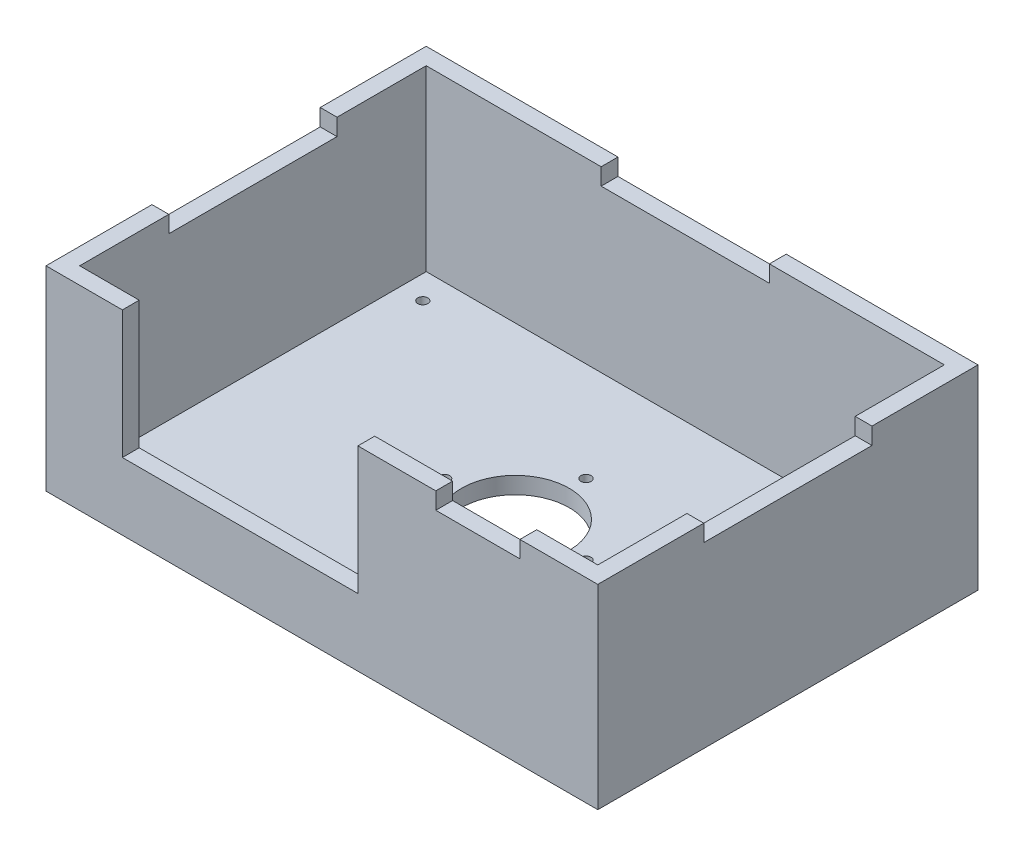
ISO-10303-21;
HEADER;
FILE_DESCRIPTION(('STEP AP214'),'2;1');
FILE_NAME('part.step','',(''),(''),'','','');
FILE_SCHEMA(('AUTOMOTIVE_DESIGN { 1 0 10303 214 1 1 1 1 }'));
ENDSEC;
DATA;
#1=APPLICATION_CONTEXT('core data for automotive mechanical design processes');
#2=APPLICATION_PROTOCOL_DEFINITION('international standard','automotive_design',2000,#1);
#3=PRODUCT_CONTEXT('',#1,'mechanical');
#4=PRODUCT('Part','Part','',(#3));
#5=PRODUCT_RELATED_PRODUCT_CATEGORY('part','',(#4));
#6=PRODUCT_DEFINITION_FORMATION('','',#4);
#7=PRODUCT_DEFINITION_CONTEXT('part definition',#1,'design');
#8=PRODUCT_DEFINITION('design','',#6,#7);
#9=PRODUCT_DEFINITION_SHAPE('','',#8);
#10=(LENGTH_UNIT() NAMED_UNIT(*) SI_UNIT(.MILLI.,.METRE.));
#11=(NAMED_UNIT(*) PLANE_ANGLE_UNIT() SI_UNIT($,.RADIAN.));
#12=(NAMED_UNIT(*) SI_UNIT($,.STERADIAN.) SOLID_ANGLE_UNIT());
#13=UNCERTAINTY_MEASURE_WITH_UNIT(LENGTH_MEASURE(1.E-05),#10,'distance_accuracy_value','');
#14=(GEOMETRIC_REPRESENTATION_CONTEXT(3) GLOBAL_UNCERTAINTY_ASSIGNED_CONTEXT((#13)) GLOBAL_UNIT_ASSIGNED_CONTEXT((#10,
#11,#12)) REPRESENTATION_CONTEXT('',''));
#15=CARTESIAN_POINT('',(0.,0.,0.));
#16=DIRECTION('',(0.,0.,1.));
#17=DIRECTION('',(1.,0.,0.));
#18=AXIS2_PLACEMENT_3D('',#15,#16,#17);
#19=CARTESIAN_POINT('',(0.,58.,0.));
#20=DIRECTION('',(0.,1.,0.));
#21=DIRECTION('',(0.,0.,1.));
#22=AXIS2_PLACEMENT_3D('',#19,#20,#21);
#23=PLANE('',#22);
#24=DIRECTION('',(0.,0.,1.));
#25=VECTOR('',#24,1.);
#26=CARTESIAN_POINT('',(33.85,58.,52.5));
#27=LINE('',#26,#25);
#28=CARTESIAN_POINT('',(33.85,58.,52.5));
#29=VERTEX_POINT('',#28);
#30=CARTESIAN_POINT('',(33.85,58.,57.5));
#31=VERTEX_POINT('',#30);
#32=EDGE_CURVE('E530',#29,#31,#27,.T.);
#33=ORIENTED_EDGE('',*,*,#32,.F.);
#34=DIRECTION('',(1.,0.,0.));
#35=VECTOR('',#34,1.);
#36=CARTESIAN_POINT('',(-77.,58.,52.5));
#37=LINE('',#36,#35);
#38=CARTESIAN_POINT('',(10.7,58.,52.5));
#39=VERTEX_POINT('',#38);
#40=EDGE_CURVE('E354',#39,#29,#37,.T.);
#41=ORIENTED_EDGE('',*,*,#40,.F.);
#42=DIRECTION('',(0.,0.,-1.));
#43=VECTOR('',#42,1.);
#44=CARTESIAN_POINT('',(10.7,58.,52.5));
#45=LINE('',#44,#43);
#46=CARTESIAN_POINT('',(10.7,58.,57.5));
#47=VERTEX_POINT('',#46);
#48=EDGE_CURVE('E324',#47,#39,#45,.T.);
#49=ORIENTED_EDGE('',*,*,#48,.F.);
#50=DIRECTION('',(1.,0.,0.));
#51=VECTOR('',#50,1.);
#52=CARTESIAN_POINT('',(-82.,58.,57.5));
#53=LINE('',#52,#51);
#54=EDGE_CURVE('E370',#47,#31,#53,.T.);
#55=ORIENTED_EDGE('',*,*,#54,.T.);
#56=EDGE_LOOP('',(#33,#41,#49,#55));
#57=FACE_BOUND('',#56,.T.);
#58=ADVANCED_FACE('F33',(#57),#23,.T.);
#59=DIRECTION('',(0.,0.,1.));
#60=VECTOR('',#59,1.);
#61=CARTESIAN_POINT('',(-25.,58.,-55.5));
#62=LINE('',#61,#60);
#63=CARTESIAN_POINT('',(-25.,58.,-55.5));
#64=VERTEX_POINT('',#63);
#65=CARTESIAN_POINT('',(-25.,58.,-50.5));
#66=VERTEX_POINT('',#65);
#67=EDGE_CURVE('E258',#64,#66,#62,.T.);
#68=ORIENTED_EDGE('',*,*,#67,.F.);
#69=DIRECTION('',(-1.,0.,0.));
#70=VECTOR('',#69,1.);
#71=CARTESIAN_POINT('',(-82.,58.,-55.5));
#72=LINE('',#71,#70);
#73=CARTESIAN_POINT('',(-82.,58.,-55.5));
#74=VERTEX_POINT('',#73);
#75=EDGE_CURVE('E374',#64,#74,#72,.T.);
#76=ORIENTED_EDGE('',*,*,#75,.T.);
#77=DIRECTION('',(0.,0.,1.));
#78=VECTOR('',#77,1.);
#79=CARTESIAN_POINT('',(-82.,58.,-55.5));
#80=LINE('',#79,#78);
#81=CARTESIAN_POINT('',(-82.,58.,-24.));
#82=VERTEX_POINT('',#81);
#83=EDGE_CURVE('E363',#74,#82,#80,.T.);
#84=ORIENTED_EDGE('',*,*,#83,.T.);
#85=DIRECTION('',(-1.,0.,0.));
#86=VECTOR('',#85,1.);
#87=CARTESIAN_POINT('',(-82.,58.,-24.));
#88=LINE('',#87,#86);
#89=CARTESIAN_POINT('',(-77.,58.,-24.));
#90=VERTEX_POINT('',#89);
#91=EDGE_CURVE('E301',#90,#82,#88,.T.);
#92=ORIENTED_EDGE('',*,*,#91,.F.);
#93=DIRECTION('',(0.,0.,1.));
#94=VECTOR('',#93,1.);
#95=CARTESIAN_POINT('',(-77.,58.,-50.5));
#96=LINE('',#95,#94);
#97=CARTESIAN_POINT('',(-77.,58.,-50.5));
#98=VERTEX_POINT('',#97);
#99=EDGE_CURVE('E346',#98,#90,#96,.T.);
#100=ORIENTED_EDGE('',*,*,#99,.F.);
#101=DIRECTION('',(-1.,0.,0.));
#102=VECTOR('',#101,1.);
#103=CARTESIAN_POINT('',(-77.,58.,-50.5));
#104=LINE('',#103,#102);
#105=EDGE_CURVE('E358',#66,#98,#104,.T.);
#106=ORIENTED_EDGE('',*,*,#105,.F.);
#107=EDGE_LOOP('',(#68,#76,#84,#92,#100,#106));
#108=FACE_BOUND('',#107,.T.);
#109=ADVANCED_FACE('F488',(#108),#23,.T.);
#110=DIRECTION('',(0.,0.,-1.));
#111=VECTOR('',#110,1.);
#112=CARTESIAN_POINT('',(25.,58.,-55.5));
#113=LINE('',#112,#111);
#114=CARTESIAN_POINT('',(25.,58.,-50.5));
#115=VERTEX_POINT('',#114);
#116=CARTESIAN_POINT('',(25.,58.,-55.5));
#117=VERTEX_POINT('',#116);
#118=EDGE_CURVE('E248',#115,#117,#113,.T.);
#119=ORIENTED_EDGE('',*,*,#118,.F.);
#120=CARTESIAN_POINT('',(77.,58.,-50.5));
#121=VERTEX_POINT('',#120);
#122=EDGE_CURVE('E359',#121,#115,#104,.T.);
#123=ORIENTED_EDGE('',*,*,#122,.F.);
#124=DIRECTION('',(0.,0.,-1.));
#125=VECTOR('',#124,1.);
#126=CARTESIAN_POINT('',(77.,58.,-50.5));
#127=LINE('',#126,#125);
#128=CARTESIAN_POINT('',(77.,58.,-24.));
#129=VERTEX_POINT('',#128);
#130=EDGE_CURVE('E353',#129,#121,#127,.T.);
#131=ORIENTED_EDGE('',*,*,#130,.F.);
#132=DIRECTION('',(-1.,0.,0.));
#133=VECTOR('',#132,1.);
#134=CARTESIAN_POINT('',(77.,58.,-24.));
#135=LINE('',#134,#133);
#136=CARTESIAN_POINT('',(81.9999999999999,58.,-24.));
#137=VERTEX_POINT('',#136);
#138=EDGE_CURVE('E276',#137,#129,#135,.T.);
#139=ORIENTED_EDGE('',*,*,#138,.F.);
#140=DIRECTION('',(0.,0.,-1.));
#141=VECTOR('',#140,1.);
#142=CARTESIAN_POINT('',(82.,58.,-55.5));
#143=LINE('',#142,#141);
#144=CARTESIAN_POINT('',(82.,58.,-55.5));
#145=VERTEX_POINT('',#144);
#146=EDGE_CURVE('E369',#137,#145,#143,.T.);
#147=ORIENTED_EDGE('',*,*,#146,.T.);
#148=EDGE_CURVE('E375',#145,#117,#72,.T.);
#149=ORIENTED_EDGE('',*,*,#148,.T.);
#150=EDGE_LOOP('',(#119,#123,#131,#139,#147,#149));
#151=FACE_BOUND('',#150,.T.);
#152=ADVANCED_FACE('F558',(#151),#23,.T.);
#153=DIRECTION('',(0.,0.,-1.));
#154=VECTOR('',#153,1.);
#155=CARTESIAN_POINT('',(58.85,58.,52.5));
#156=LINE('',#155,#154);
#157=CARTESIAN_POINT('',(58.85,58.,57.5));
#158=VERTEX_POINT('',#157);
#159=CARTESIAN_POINT('',(58.85,58.,52.5));
#160=VERTEX_POINT('',#159);
#161=EDGE_CURVE('E913',#158,#160,#156,.T.);
#162=ORIENTED_EDGE('',*,*,#161,.F.);
#163=CARTESIAN_POINT('',(81.9999999999999,58.,57.5));
#164=VERTEX_POINT('',#163);
#165=EDGE_CURVE('E236',#158,#164,#53,.T.);
#166=ORIENTED_EDGE('',*,*,#165,.T.);
#167=CARTESIAN_POINT('',(81.9999999999999,58.,26.));
#168=VERTEX_POINT('',#167);
#169=EDGE_CURVE('E371',#164,#168,#143,.T.);
#170=ORIENTED_EDGE('',*,*,#169,.T.);
#171=DIRECTION('',(1.,0.,0.));
#172=VECTOR('',#171,1.);
#173=CARTESIAN_POINT('',(77.,58.,26.));
#174=LINE('',#173,#172);
#175=CARTESIAN_POINT('',(77.,58.,26.));
#176=VERTEX_POINT('',#175);
#177=EDGE_CURVE('E285',#176,#168,#174,.T.);
#178=ORIENTED_EDGE('',*,*,#177,.F.);
#179=CARTESIAN_POINT('',(77.,58.,52.5));
#180=VERTEX_POINT('',#179);
#181=EDGE_CURVE('E355',#180,#176,#127,.T.);
#182=ORIENTED_EDGE('',*,*,#181,.F.);
#183=EDGE_CURVE('E349',#160,#180,#37,.T.);
#184=ORIENTED_EDGE('',*,*,#183,.F.);
#185=EDGE_LOOP('',(#162,#166,#170,#178,#182,#184));
#186=FACE_BOUND('',#185,.T.);
#187=ADVANCED_FACE('F539',(#186),#23,.T.);
#188=CARTESIAN_POINT('',(0.,5.,0.));
#189=DIRECTION('',(0.,-1.,0.));
#190=DIRECTION('',(0.,0.,-1.));
#191=AXIS2_PLACEMENT_3D('',#188,#189,#190);
#192=PLANE('',#191);
#193=CARTESIAN_POINT('',(70.,5.,-42.5));
#194=DIRECTION('',(0.,1.,0.));
#195=DIRECTION('',(0.,0.,1.));
#196=AXIS2_PLACEMENT_3D('',#193,#194,#195);
#197=CIRCLE('',#196,1.5);
#198=CARTESIAN_POINT('',(70.,5.,-41.));
#199=VERTEX_POINT('',#198);
#200=EDGE_CURVE('E416',#199,#199,#197,.T.);
#201=ORIENTED_EDGE('',*,*,#200,.F.);
#202=EDGE_LOOP('',(#201));
#203=FACE_BOUND('',#202,.T.);
#204=CARTESIAN_POINT('',(-70.,5.,-42.5));
#205=DIRECTION('',(0.,1.,0.));
#206=DIRECTION('',(0.,0.,1.));
#207=AXIS2_PLACEMENT_3D('',#204,#205,#206);
#208=CIRCLE('',#207,1.5);
#209=CARTESIAN_POINT('',(-70.,5.,-41.));
#210=VERTEX_POINT('',#209);
#211=EDGE_CURVE('E427',#210,#210,#208,.T.);
#212=ORIENTED_EDGE('',*,*,#211,.F.);
#213=EDGE_LOOP('',(#212));
#214=FACE_BOUND('',#213,.T.);
#215=CARTESIAN_POINT('',(-70.,5.,45.5));
#216=DIRECTION('',(0.,1.,0.));
#217=DIRECTION('',(0.,0.,1.));
#218=AXIS2_PLACEMENT_3D('',#215,#216,#217);
#219=CIRCLE('',#218,1.5);
#220=CARTESIAN_POINT('',(-70.,5.,47.));
#221=VERTEX_POINT('',#220);
#222=EDGE_CURVE('E421',#221,#221,#219,.T.);
#223=ORIENTED_EDGE('',*,*,#222,.F.);
#224=EDGE_LOOP('',(#223));
#225=FACE_BOUND('',#224,.T.);
#226=CARTESIAN_POINT('',(70.,5.,45.5));
#227=DIRECTION('',(0.,1.,0.));
#228=DIRECTION('',(0.,0.,1.));
#229=AXIS2_PLACEMENT_3D('',#226,#227,#228);
#230=CIRCLE('',#229,1.5);
#231=CARTESIAN_POINT('',(70.,5.,47.));
#232=VERTEX_POINT('',#231);
#233=EDGE_CURVE('E420',#232,#232,#230,.T.);
#234=ORIENTED_EDGE('',*,*,#233,.F.);
#235=EDGE_LOOP('',(#234));
#236=FACE_BOUND('',#235,.T.);
#237=CARTESIAN_POINT('',(0.,5.,-21.));
#238=DIRECTION('',(0.,1.,0.));
#239=DIRECTION('',(0.,0.,1.));
#240=AXIS2_PLACEMENT_3D('',#237,#238,#239);
#241=CIRCLE('',#240,1.5);
#242=CARTESIAN_POINT('',(0.,5.,-19.5));
#243=VERTEX_POINT('',#242);
#244=EDGE_CURVE('E453',#243,#243,#241,.T.);
#245=ORIENTED_EDGE('',*,*,#244,.F.);
#246=EDGE_LOOP('',(#245));
#247=FACE_BOUND('',#246,.T.);
#248=CARTESIAN_POINT('',(-21.,5.,0.));
#249=DIRECTION('',(0.,1.,0.));
#250=DIRECTION('',(0.,0.,1.));
#251=AXIS2_PLACEMENT_3D('',#248,#249,#250);
#252=CIRCLE('',#251,1.5);
#253=CARTESIAN_POINT('',(-21.,5.,1.5));
#254=VERTEX_POINT('',#253);
#255=EDGE_CURVE('E460',#254,#254,#252,.T.);
#256=ORIENTED_EDGE('',*,*,#255,.F.);
#257=EDGE_LOOP('',(#256));
#258=FACE_BOUND('',#257,.T.);
#259=CARTESIAN_POINT('',(21.,5.,0.));
#260=DIRECTION('',(0.,1.,0.));
#261=DIRECTION('',(0.,0.,1.));
#262=AXIS2_PLACEMENT_3D('',#259,#260,#261);
#263=CIRCLE('',#262,1.5);
#264=CARTESIAN_POINT('',(21.,5.,1.5));
#265=VERTEX_POINT('',#264);
#266=EDGE_CURVE('E441',#265,#265,#263,.T.);
#267=ORIENTED_EDGE('',*,*,#266,.F.);
#268=EDGE_LOOP('',(#267));
#269=FACE_BOUND('',#268,.T.);
#270=CARTESIAN_POINT('',(0.,5.,21.));
#271=DIRECTION('',(0.,1.,0.));
#272=DIRECTION('',(0.,0.,1.));
#273=AXIS2_PLACEMENT_3D('',#270,#271,#272);
#274=CIRCLE('',#273,1.5);
#275=CARTESIAN_POINT('',(0.,5.,22.5));
#276=VERTEX_POINT('',#275);
#277=EDGE_CURVE('E448',#276,#276,#274,.T.);
#278=ORIENTED_EDGE('',*,*,#277,.F.);
#279=EDGE_LOOP('',(#278));
#280=FACE_BOUND('',#279,.T.);
#281=CARTESIAN_POINT('',(0.,5.,0.));
#282=DIRECTION('',(0.,1.,0.));
#283=DIRECTION('',(0.,0.,1.));
#284=AXIS2_PLACEMENT_3D('',#281,#282,#283);
#285=CIRCLE('',#284,16.);
#286=CARTESIAN_POINT('',(0.,5.,16.));
#287=VERTEX_POINT('',#286);
#288=EDGE_CURVE('E456',#287,#287,#285,.T.);
#289=ORIENTED_EDGE('',*,*,#288,.F.);
#290=EDGE_LOOP('',(#289));
#291=FACE_BOUND('',#290,.T.);
#292=DIRECTION('',(0.,0.,-1.));
#293=VECTOR('',#292,1.);
#294=CARTESIAN_POINT('',(77.,5.,50.5));
#295=LINE('',#294,#293);
#296=CARTESIAN_POINT('',(77.,5.,52.5));
#297=VERTEX_POINT('',#296);
#298=CARTESIAN_POINT('',(77.,5.,-50.5));
#299=VERTEX_POINT('',#298);
#300=EDGE_CURVE('E468',#297,#299,#295,.T.);
#301=ORIENTED_EDGE('',*,*,#300,.T.);
#302=DIRECTION('',(-1.,0.,0.));
#303=VECTOR('',#302,1.);
#304=CARTESIAN_POINT('',(-77.,5.,-50.5));
#305=LINE('',#304,#303);
#306=CARTESIAN_POINT('',(-77.,5.,-50.5));
#307=VERTEX_POINT('',#306);
#308=EDGE_CURVE('E41',#299,#307,#305,.T.);
#309=ORIENTED_EDGE('',*,*,#308,.T.);
#310=DIRECTION('',(0.,0.,1.));
#311=VECTOR('',#310,1.);
#312=CARTESIAN_POINT('',(-77.,5.,50.5));
#313=LINE('',#312,#311);
#314=CARTESIAN_POINT('',(-77.,5.,52.5));
#315=VERTEX_POINT('',#314);
#316=EDGE_CURVE('E11',#307,#315,#313,.T.);
#317=ORIENTED_EDGE('',*,*,#316,.T.);
#318=DIRECTION('',(-1.,0.,0.));
#319=VECTOR('',#318,1.);
#320=CARTESIAN_POINT('',(77.,5.,52.5));
#321=LINE('',#320,#319);
#322=EDGE_CURVE('E406',#297,#315,#321,.T.);
#323=ORIENTED_EDGE('',*,*,#322,.F.);
#324=EDGE_LOOP('',(#301,#309,#317,#323));
#325=FACE_BOUND('',#324,.T.);
#326=ADVANCED_FACE('F474',(#203,#214,#225,#236,#247,#258,#269,#280,#291,#325),#192,.F.);
#327=CARTESIAN_POINT('',(0.,0.,0.));
#328=DIRECTION('',(0.,-1.,0.));
#329=DIRECTION('',(0.,0.,-1.));
#330=AXIS2_PLACEMENT_3D('',#327,#328,#329);
#331=PLANE('',#330);
#332=CARTESIAN_POINT('',(70.,0.,-42.5));
#333=DIRECTION('',(0.,1.,0.));
#334=DIRECTION('',(0.,0.,1.));
#335=AXIS2_PLACEMENT_3D('',#332,#333,#334);
#336=CIRCLE('',#335,1.5);
#337=CARTESIAN_POINT('',(70.,0.,-41.));
#338=VERTEX_POINT('',#337);
#339=EDGE_CURVE('E430',#338,#338,#336,.T.);
#340=ORIENTED_EDGE('',*,*,#339,.T.);
#341=EDGE_LOOP('',(#340));
#342=FACE_BOUND('',#341,.T.);
#343=CARTESIAN_POINT('',(-70.,0.,-42.5));
#344=DIRECTION('',(0.,1.,0.));
#345=DIRECTION('',(0.,0.,1.));
#346=AXIS2_PLACEMENT_3D('',#343,#344,#345);
#347=CIRCLE('',#346,1.5);
#348=CARTESIAN_POINT('',(-70.,0.,-41.));
#349=VERTEX_POINT('',#348);
#350=EDGE_CURVE('E424',#349,#349,#347,.T.);
#351=ORIENTED_EDGE('',*,*,#350,.T.);
#352=EDGE_LOOP('',(#351));
#353=FACE_BOUND('',#352,.T.);
#354=CARTESIAN_POINT('',(-70.,0.,45.5));
#355=DIRECTION('',(0.,1.,0.));
#356=DIRECTION('',(0.,0.,1.));
#357=AXIS2_PLACEMENT_3D('',#354,#355,#356);
#358=CIRCLE('',#357,1.5);
#359=CARTESIAN_POINT('',(-70.,0.,47.));
#360=VERTEX_POINT('',#359);
#361=EDGE_CURVE('E417',#360,#360,#358,.T.);
#362=ORIENTED_EDGE('',*,*,#361,.T.);
#363=EDGE_LOOP('',(#362));
#364=FACE_BOUND('',#363,.T.);
#365=CARTESIAN_POINT('',(70.,0.,45.5));
#366=DIRECTION('',(0.,1.,0.));
#367=DIRECTION('',(0.,0.,1.));
#368=AXIS2_PLACEMENT_3D('',#365,#366,#367);
#369=CIRCLE('',#368,1.5);
#370=CARTESIAN_POINT('',(70.,0.,47.));
#371=VERTEX_POINT('',#370);
#372=EDGE_CURVE('E435',#371,#371,#369,.T.);
#373=ORIENTED_EDGE('',*,*,#372,.T.);
#374=EDGE_LOOP('',(#373));
#375=FACE_BOUND('',#374,.T.);
#376=CARTESIAN_POINT('',(0.,0.,-21.));
#377=DIRECTION('',(0.,1.,0.));
#378=DIRECTION('',(0.,0.,1.));
#379=AXIS2_PLACEMENT_3D('',#376,#377,#378);
#380=CIRCLE('',#379,1.5);
#381=CARTESIAN_POINT('',(0.,0.,-19.5));
#382=VERTEX_POINT('',#381);
#383=EDGE_CURVE('E457',#382,#382,#380,.T.);
#384=ORIENTED_EDGE('',*,*,#383,.T.);
#385=EDGE_LOOP('',(#384));
#386=FACE_BOUND('',#385,.T.);
#387=CARTESIAN_POINT('',(-21.,0.,0.));
#388=DIRECTION('',(0.,1.,0.));
#389=DIRECTION('',(0.,0.,1.));
#390=AXIS2_PLACEMENT_3D('',#387,#388,#389);
#391=CIRCLE('',#390,1.5);
#392=CARTESIAN_POINT('',(-21.,0.,1.5));
#393=VERTEX_POINT('',#392);
#394=EDGE_CURVE('E444',#393,#393,#391,.T.);
#395=ORIENTED_EDGE('',*,*,#394,.T.);
#396=EDGE_LOOP('',(#395));
#397=FACE_BOUND('',#396,.T.);
#398=CARTESIAN_POINT('',(21.,0.,0.));
#399=DIRECTION('',(0.,1.,0.));
#400=DIRECTION('',(0.,0.,1.));
#401=AXIS2_PLACEMENT_3D('',#398,#399,#400);
#402=CIRCLE('',#401,1.5);
#403=CARTESIAN_POINT('',(21.,0.,1.5));
#404=VERTEX_POINT('',#403);
#405=EDGE_CURVE('E445',#404,#404,#402,.T.);
#406=ORIENTED_EDGE('',*,*,#405,.T.);
#407=EDGE_LOOP('',(#406));
#408=FACE_BOUND('',#407,.T.);
#409=CARTESIAN_POINT('',(0.,0.,21.));
#410=DIRECTION('',(0.,1.,0.));
#411=DIRECTION('',(0.,0.,1.));
#412=AXIS2_PLACEMENT_3D('',#409,#410,#411);
#413=CIRCLE('',#412,1.5);
#414=CARTESIAN_POINT('',(0.,0.,22.5));
#415=VERTEX_POINT('',#414);
#416=EDGE_CURVE('E438',#415,#415,#413,.T.);
#417=ORIENTED_EDGE('',*,*,#416,.T.);
#418=EDGE_LOOP('',(#417));
#419=FACE_BOUND('',#418,.T.);
#420=CARTESIAN_POINT('',(0.,0.,0.));
#421=DIRECTION('',(0.,1.,0.));
#422=DIRECTION('',(0.,0.,1.));
#423=AXIS2_PLACEMENT_3D('',#420,#421,#422);
#424=CIRCLE('',#423,16.);
#425=CARTESIAN_POINT('',(0.,0.,16.));
#426=VERTEX_POINT('',#425);
#427=EDGE_CURVE('E465',#426,#426,#424,.T.);
#428=ORIENTED_EDGE('',*,*,#427,.T.);
#429=EDGE_LOOP('',(#428));
#430=FACE_BOUND('',#429,.T.);
#431=DIRECTION('',(0.,0.,1.));
#432=VECTOR('',#431,1.);
#433=CARTESIAN_POINT('',(-82.,0.,-55.5));
#434=LINE('',#433,#432);
#435=CARTESIAN_POINT('',(-82.,0.,-55.5));
#436=VERTEX_POINT('',#435);
#437=CARTESIAN_POINT('',(-82.,0.,57.5));
#438=VERTEX_POINT('',#437);
#439=EDGE_CURVE('E382',#436,#438,#434,.T.);
#440=ORIENTED_EDGE('',*,*,#439,.F.);
#441=DIRECTION('',(-1.,0.,0.));
#442=VECTOR('',#441,1.);
#443=CARTESIAN_POINT('',(-82.,0.,-55.5));
#444=LINE('',#443,#442);
#445=CARTESIAN_POINT('',(82.,0.,-55.5));
#446=VERTEX_POINT('',#445);
#447=EDGE_CURVE('E399',#446,#436,#444,.T.);
#448=ORIENTED_EDGE('',*,*,#447,.F.);
#449=DIRECTION('',(0.,0.,-1.));
#450=VECTOR('',#449,1.);
#451=CARTESIAN_POINT('',(82.,0.,-55.5));
#452=LINE('',#451,#450);
#453=CARTESIAN_POINT('',(81.9999999999999,0.,57.5));
#454=VERTEX_POINT('',#453);
#455=EDGE_CURVE('E396',#454,#446,#452,.T.);
#456=ORIENTED_EDGE('',*,*,#455,.F.);
#457=DIRECTION('',(1.,0.,0.));
#458=VECTOR('',#457,1.);
#459=CARTESIAN_POINT('',(-82.,0.,57.5));
#460=LINE('',#459,#458);
#461=EDGE_CURVE('E393',#438,#454,#460,.T.);
#462=ORIENTED_EDGE('',*,*,#461,.F.);
#463=EDGE_LOOP('',(#440,#448,#456,#462));
#464=FACE_BOUND('',#463,.T.);
#465=ADVANCED_FACE('F35',(#342,#353,#364,#375,#386,#397,#408,#419,#430,#464),#331,.T.);
#466=CARTESIAN_POINT('',(0.,0.,0.));
#467=DIRECTION('',(0.,1.,0.));
#468=DIRECTION('',(0.,0.,1.));
#469=AXIS2_PLACEMENT_3D('',#466,#467,#468);
#470=CYLINDRICAL_SURFACE('',#469,16.);
#471=ORIENTED_EDGE('',*,*,#427,.F.);
#472=EDGE_LOOP('',(#471));
#473=FACE_BOUND('',#472,.T.);
#474=ORIENTED_EDGE('',*,*,#288,.T.);
#475=EDGE_LOOP('',(#474));
#476=FACE_BOUND('',#475,.T.);
#477=ADVANCED_FACE('F577',(#473,#476),#470,.F.);
#478=CARTESIAN_POINT('',(0.,0.,21.));
#479=DIRECTION('',(0.,1.,0.));
#480=DIRECTION('',(0.,0.,1.));
#481=AXIS2_PLACEMENT_3D('',#478,#479,#480);
#482=CYLINDRICAL_SURFACE('',#481,1.5);
#483=ORIENTED_EDGE('',*,*,#416,.F.);
#484=EDGE_LOOP('',(#483));
#485=FACE_BOUND('',#484,.T.);
#486=ORIENTED_EDGE('',*,*,#277,.T.);
#487=EDGE_LOOP('',(#486));
#488=FACE_BOUND('',#487,.T.);
#489=ADVANCED_FACE('F583',(#485,#488),#482,.F.);
#490=CARTESIAN_POINT('',(21.,0.,0.));
#491=DIRECTION('',(0.,1.,0.));
#492=DIRECTION('',(0.,0.,1.));
#493=AXIS2_PLACEMENT_3D('',#490,#491,#492);
#494=CYLINDRICAL_SURFACE('',#493,1.5);
#495=ORIENTED_EDGE('',*,*,#405,.F.);
#496=EDGE_LOOP('',(#495));
#497=FACE_BOUND('',#496,.T.);
#498=ORIENTED_EDGE('',*,*,#266,.T.);
#499=EDGE_LOOP('',(#498));
#500=FACE_BOUND('',#499,.T.);
#501=ADVANCED_FACE('F712',(#497,#500),#494,.F.);
#502=CARTESIAN_POINT('',(-21.,0.,0.));
#503=DIRECTION('',(0.,1.,0.));
#504=DIRECTION('',(0.,0.,1.));
#505=AXIS2_PLACEMENT_3D('',#502,#503,#504);
#506=CYLINDRICAL_SURFACE('',#505,1.5);
#507=ORIENTED_EDGE('',*,*,#394,.F.);
#508=EDGE_LOOP('',(#507));
#509=FACE_BOUND('',#508,.T.);
#510=ORIENTED_EDGE('',*,*,#255,.T.);
#511=EDGE_LOOP('',(#510));
#512=FACE_BOUND('',#511,.T.);
#513=ADVANCED_FACE('F702',(#509,#512),#506,.F.);
#514=CARTESIAN_POINT('',(0.,0.,-21.));
#515=DIRECTION('',(0.,1.,0.));
#516=DIRECTION('',(0.,0.,1.));
#517=AXIS2_PLACEMENT_3D('',#514,#515,#516);
#518=CYLINDRICAL_SURFACE('',#517,1.5);
#519=ORIENTED_EDGE('',*,*,#383,.F.);
#520=EDGE_LOOP('',(#519));
#521=FACE_BOUND('',#520,.T.);
#522=ORIENTED_EDGE('',*,*,#244,.T.);
#523=EDGE_LOOP('',(#522));
#524=FACE_BOUND('',#523,.T.);
#525=ADVANCED_FACE('F692',(#521,#524),#518,.F.);
#526=CARTESIAN_POINT('',(70.,0.,45.5));
#527=DIRECTION('',(0.,1.,0.));
#528=DIRECTION('',(0.,0.,1.));
#529=AXIS2_PLACEMENT_3D('',#526,#527,#528);
#530=CYLINDRICAL_SURFACE('',#529,1.5);
#531=ORIENTED_EDGE('',*,*,#372,.F.);
#532=EDGE_LOOP('',(#531));
#533=FACE_BOUND('',#532,.T.);
#534=ORIENTED_EDGE('',*,*,#233,.T.);
#535=EDGE_LOOP('',(#534));
#536=FACE_BOUND('',#535,.T.);
#537=ADVANCED_FACE('F682',(#533,#536),#530,.F.);
#538=CARTESIAN_POINT('',(-70.,0.,45.5));
#539=DIRECTION('',(0.,1.,0.));
#540=DIRECTION('',(0.,0.,1.));
#541=AXIS2_PLACEMENT_3D('',#538,#539,#540);
#542=CYLINDRICAL_SURFACE('',#541,1.5);
#543=ORIENTED_EDGE('',*,*,#361,.F.);
#544=EDGE_LOOP('',(#543));
#545=FACE_BOUND('',#544,.T.);
#546=ORIENTED_EDGE('',*,*,#222,.T.);
#547=EDGE_LOOP('',(#546));
#548=FACE_BOUND('',#547,.T.);
#549=ADVANCED_FACE('F672',(#545,#548),#542,.F.);
#550=CARTESIAN_POINT('',(-70.,0.,-42.5));
#551=DIRECTION('',(0.,1.,0.));
#552=DIRECTION('',(0.,0.,1.));
#553=AXIS2_PLACEMENT_3D('',#550,#551,#552);
#554=CYLINDRICAL_SURFACE('',#553,1.5);
#555=ORIENTED_EDGE('',*,*,#350,.F.);
#556=EDGE_LOOP('',(#555));
#557=FACE_BOUND('',#556,.T.);
#558=ORIENTED_EDGE('',*,*,#211,.T.);
#559=EDGE_LOOP('',(#558));
#560=FACE_BOUND('',#559,.T.);
#561=ADVANCED_FACE('F660',(#557,#560),#554,.F.);
#562=CARTESIAN_POINT('',(70.,0.,-42.5));
#563=DIRECTION('',(0.,1.,0.));
#564=DIRECTION('',(0.,0.,1.));
#565=AXIS2_PLACEMENT_3D('',#562,#563,#564);
#566=CYLINDRICAL_SURFACE('',#565,1.5);
#567=ORIENTED_EDGE('',*,*,#339,.F.);
#568=EDGE_LOOP('',(#567));
#569=FACE_BOUND('',#568,.T.);
#570=ORIENTED_EDGE('',*,*,#200,.T.);
#571=EDGE_LOOP('',(#570));
#572=FACE_BOUND('',#571,.T.);
#573=ADVANCED_FACE('F655',(#569,#572),#566,.F.);
#574=CARTESIAN_POINT('',(-77.,0.,-50.5));
#575=DIRECTION('',(0.,0.,-1.));
#576=DIRECTION('',(-1.,0.,0.));
#577=AXIS2_PLACEMENT_3D('',#574,#575,#576);
#578=PLANE('',#577);
#579=DIRECTION('',(1.,0.,0.));
#580=VECTOR('',#579,1.);
#581=CARTESIAN_POINT('',(-25.,53.,-50.5));
#582=LINE('',#581,#580);
#583=CARTESIAN_POINT('',(-25.,53.,-50.5));
#584=VERTEX_POINT('',#583);
#585=CARTESIAN_POINT('',(25.,53.,-50.5));
#586=VERTEX_POINT('',#585);
#587=EDGE_CURVE('E247',#584,#586,#582,.T.);
#588=ORIENTED_EDGE('',*,*,#587,.F.);
#589=DIRECTION('',(0.,1.,0.));
#590=VECTOR('',#589,1.);
#591=CARTESIAN_POINT('',(-25.,53.,-50.5));
#592=LINE('',#591,#590);
#593=EDGE_CURVE('E257',#584,#66,#592,.T.);
#594=ORIENTED_EDGE('',*,*,#593,.T.);
#595=ORIENTED_EDGE('',*,*,#105,.T.);
#596=DIRECTION('',(0.,1.,0.));
#597=VECTOR('',#596,1.);
#598=CARTESIAN_POINT('',(-77.,0.,-50.5));
#599=LINE('',#598,#597);
#600=EDGE_CURVE('E379',#307,#98,#599,.T.);
#601=ORIENTED_EDGE('',*,*,#600,.F.);
#602=ORIENTED_EDGE('',*,*,#308,.F.);
#603=DIRECTION('',(0.,1.,0.));
#604=VECTOR('',#603,1.);
#605=CARTESIAN_POINT('',(77.,0.,-50.5));
#606=LINE('',#605,#604);
#607=EDGE_CURVE('E383',#299,#121,#606,.T.);
#608=ORIENTED_EDGE('',*,*,#607,.T.);
#609=ORIENTED_EDGE('',*,*,#122,.T.);
#610=DIRECTION('',(0.,1.,0.));
#611=VECTOR('',#610,1.);
#612=CARTESIAN_POINT('',(25.,53.,-50.5));
#613=LINE('',#612,#611);
#614=EDGE_CURVE('E268',#586,#115,#613,.T.);
#615=ORIENTED_EDGE('',*,*,#614,.F.);
#616=EDGE_LOOP('',(#588,#594,#595,#601,#602,#608,#609,#615));
#617=FACE_BOUND('',#616,.T.);
#618=ADVANCED_FACE('F484',(#617),#578,.F.);
#619=CARTESIAN_POINT('',(-77.,0.,52.5));
#620=DIRECTION('',(0.,0.,1.));
#621=DIRECTION('',(1.,0.,0.));
#622=AXIS2_PLACEMENT_3D('',#619,#620,#621);
#623=PLANE('',#622);
#624=ORIENTED_EDGE('',*,*,#40,.T.);
#625=DIRECTION('',(0.,1.,0.));
#626=VECTOR('',#625,1.);
#627=CARTESIAN_POINT('',(33.85,53.,52.5));
#628=LINE('',#627,#626);
#629=CARTESIAN_POINT('',(33.85,53.,52.5));
#630=VERTEX_POINT('',#629);
#631=EDGE_CURVE('E239',#630,#29,#628,.T.);
#632=ORIENTED_EDGE('',*,*,#631,.F.);
#633=DIRECTION('',(-1.,0.,0.));
#634=VECTOR('',#633,1.);
#635=CARTESIAN_POINT('',(33.85,53.,52.5));
#636=LINE('',#635,#634);
#637=CARTESIAN_POINT('',(58.85,53.,52.5));
#638=VERTEX_POINT('',#637);
#639=EDGE_CURVE('E225',#638,#630,#636,.T.);
#640=ORIENTED_EDGE('',*,*,#639,.F.);
#641=DIRECTION('',(0.,1.,0.));
#642=VECTOR('',#641,1.);
#643=CARTESIAN_POINT('',(58.85,53.,52.5));
#644=LINE('',#643,#642);
#645=EDGE_CURVE('E223',#638,#160,#644,.T.);
#646=ORIENTED_EDGE('',*,*,#645,.T.);
#647=ORIENTED_EDGE('',*,*,#183,.T.);
#648=DIRECTION('',(0.,1.,0.));
#649=VECTOR('',#648,1.);
#650=CARTESIAN_POINT('',(77.,0.,52.5));
#651=LINE('',#650,#649);
#652=EDGE_CURVE('E386',#297,#180,#651,.T.);
#653=ORIENTED_EDGE('',*,*,#652,.F.);
#654=ORIENTED_EDGE('',*,*,#322,.T.);
#655=DIRECTION('',(0.,1.,0.));
#656=VECTOR('',#655,1.);
#657=CARTESIAN_POINT('',(-77.,0.,52.5));
#658=LINE('',#657,#656);
#659=CARTESIAN_POINT('',(-77.,58.,52.5));
#660=VERTEX_POINT('',#659);
#661=EDGE_CURVE('E378',#315,#660,#658,.T.);
#662=ORIENTED_EDGE('',*,*,#661,.T.);
#663=CARTESIAN_POINT('',(-59.3,58.,52.5));
#664=VERTEX_POINT('',#663);
#665=EDGE_CURVE('E350',#660,#664,#37,.T.);
#666=ORIENTED_EDGE('',*,*,#665,.T.);
#667=DIRECTION('',(0.,1.,0.));
#668=VECTOR('',#667,1.);
#669=CARTESIAN_POINT('',(-59.3,20.,52.5));
#670=LINE('',#669,#668);
#671=CARTESIAN_POINT('',(-59.3,20.,52.5));
#672=VERTEX_POINT('',#671);
#673=EDGE_CURVE('E336',#672,#664,#670,.T.);
#674=ORIENTED_EDGE('',*,*,#673,.F.);
#675=DIRECTION('',(-1.,0.,0.));
#676=VECTOR('',#675,1.);
#677=CARTESIAN_POINT('',(-59.3,20.,52.5));
#678=LINE('',#677,#676);
#679=CARTESIAN_POINT('',(10.7,20.,52.5));
#680=VERTEX_POINT('',#679);
#681=EDGE_CURVE('E330',#680,#672,#678,.T.);
#682=ORIENTED_EDGE('',*,*,#681,.F.);
#683=DIRECTION('',(0.,1.,0.));
#684=VECTOR('',#683,1.);
#685=CARTESIAN_POINT('',(10.7,20.,52.5));
#686=LINE('',#685,#684);
#687=EDGE_CURVE('E339',#680,#39,#686,.T.);
#688=ORIENTED_EDGE('',*,*,#687,.T.);
#689=EDGE_LOOP('',(#624,#632,#640,#646,#647,#653,#654,#662,#666,#674,#682,#688));
#690=FACE_BOUND('',#689,.T.);
#691=ADVANCED_FACE('F512',(#690),#623,.F.);
#692=CARTESIAN_POINT('',(-77.,0.,-50.5));
#693=DIRECTION('',(-1.,0.,0.));
#694=DIRECTION('',(0.,0.,1.));
#695=AXIS2_PLACEMENT_3D('',#692,#693,#694);
#696=PLANE('',#695);
#697=ORIENTED_EDGE('',*,*,#99,.T.);
#698=DIRECTION('',(0.,1.,0.));
#699=VECTOR('',#698,1.);
#700=CARTESIAN_POINT('',(-77.,53.,-24.));
#701=LINE('',#700,#699);
#702=CARTESIAN_POINT('',(-77.,53.,-24.));
#703=VERTEX_POINT('',#702);
#704=EDGE_CURVE('E314',#703,#90,#701,.T.);
#705=ORIENTED_EDGE('',*,*,#704,.F.);
#706=DIRECTION('',(0.,0.,-1.));
#707=VECTOR('',#706,1.);
#708=CARTESIAN_POINT('',(-77.,53.,-24.));
#709=LINE('',#708,#707);
#710=CARTESIAN_POINT('',(-77.,53.,26.));
#711=VERTEX_POINT('',#710);
#712=EDGE_CURVE('E304',#711,#703,#709,.T.);
#713=ORIENTED_EDGE('',*,*,#712,.F.);
#714=DIRECTION('',(0.,1.,0.));
#715=VECTOR('',#714,1.);
#716=CARTESIAN_POINT('',(-77.,53.,26.));
#717=LINE('',#716,#715);
#718=CARTESIAN_POINT('',(-77.,58.,26.));
#719=VERTEX_POINT('',#718);
#720=EDGE_CURVE('E316',#711,#719,#717,.T.);
#721=ORIENTED_EDGE('',*,*,#720,.T.);
#722=EDGE_CURVE('E338',#719,#660,#96,.T.);
#723=ORIENTED_EDGE('',*,*,#722,.T.);
#724=ORIENTED_EDGE('',*,*,#661,.F.);
#725=ORIENTED_EDGE('',*,*,#316,.F.);
#726=ORIENTED_EDGE('',*,*,#600,.T.);
#727=EDGE_LOOP('',(#697,#705,#713,#721,#723,#724,#725,#726));
#728=FACE_BOUND('',#727,.T.);
#729=ADVANCED_FACE('F481',(#728),#696,.F.);
#730=CARTESIAN_POINT('',(77.,0.,-50.5));
#731=DIRECTION('',(1.,0.,0.));
#732=DIRECTION('',(0.,0.,-1.));
#733=AXIS2_PLACEMENT_3D('',#730,#731,#732);
#734=PLANE('',#733);
#735=DIRECTION('',(0.,0.,1.));
#736=VECTOR('',#735,1.);
#737=CARTESIAN_POINT('',(77.,53.,-24.));
#738=LINE('',#737,#736);
#739=CARTESIAN_POINT('',(77.,53.,-24.));
#740=VERTEX_POINT('',#739);
#741=CARTESIAN_POINT('',(77.,53.,26.));
#742=VERTEX_POINT('',#741);
#743=EDGE_CURVE('E272',#740,#742,#738,.T.);
#744=ORIENTED_EDGE('',*,*,#743,.F.);
#745=DIRECTION('',(0.,1.,0.));
#746=VECTOR('',#745,1.);
#747=CARTESIAN_POINT('',(77.,53.,-24.));
#748=LINE('',#747,#746);
#749=EDGE_CURVE('E260',#740,#129,#748,.T.);
#750=ORIENTED_EDGE('',*,*,#749,.T.);
#751=ORIENTED_EDGE('',*,*,#130,.T.);
#752=ORIENTED_EDGE('',*,*,#607,.F.);
#753=ORIENTED_EDGE('',*,*,#300,.F.);
#754=ORIENTED_EDGE('',*,*,#652,.T.);
#755=ORIENTED_EDGE('',*,*,#181,.T.);
#756=DIRECTION('',(0.,1.,0.));
#757=VECTOR('',#756,1.);
#758=CARTESIAN_POINT('',(77.,53.,26.));
#759=LINE('',#758,#757);
#760=EDGE_CURVE('E284',#742,#176,#759,.T.);
#761=ORIENTED_EDGE('',*,*,#760,.F.);
#762=EDGE_LOOP('',(#744,#750,#751,#752,#753,#754,#755,#761));
#763=FACE_BOUND('',#762,.T.);
#764=ADVANCED_FACE('F536',(#763),#734,.F.);
#765=CARTESIAN_POINT('',(-82.,0.,-55.5));
#766=DIRECTION('',(-1.,0.,0.));
#767=DIRECTION('',(0.,0.,1.));
#768=AXIS2_PLACEMENT_3D('',#765,#766,#767);
#769=PLANE('',#768);
#770=DIRECTION('',(0.,1.,0.));
#771=VECTOR('',#770,1.);
#772=CARTESIAN_POINT('',(-82.,53.,-24.));
#773=LINE('',#772,#771);
#774=CARTESIAN_POINT('',(-82.,53.,-24.));
#775=VERTEX_POINT('',#774);
#776=EDGE_CURVE('E287',#775,#82,#773,.T.);
#777=ORIENTED_EDGE('',*,*,#776,.T.);
#778=ORIENTED_EDGE('',*,*,#83,.F.);
#779=DIRECTION('',(0.,1.,0.));
#780=VECTOR('',#779,1.);
#781=CARTESIAN_POINT('',(-82.,0.,-55.5));
#782=LINE('',#781,#780);
#783=EDGE_CURVE('E403',#436,#74,#782,.T.);
#784=ORIENTED_EDGE('',*,*,#783,.F.);
#785=ORIENTED_EDGE('',*,*,#439,.T.);
#786=DIRECTION('',(0.,1.,0.));
#787=VECTOR('',#786,1.);
#788=CARTESIAN_POINT('',(-82.,0.,57.5));
#789=LINE('',#788,#787);
#790=CARTESIAN_POINT('',(-82.,58.,57.5));
#791=VERTEX_POINT('',#790);
#792=EDGE_CURVE('E402',#438,#791,#789,.T.);
#793=ORIENTED_EDGE('',*,*,#792,.T.);
#794=CARTESIAN_POINT('',(-82.,58.,26.));
#795=VERTEX_POINT('',#794);
#796=EDGE_CURVE('E362',#795,#791,#80,.T.);
#797=ORIENTED_EDGE('',*,*,#796,.F.);
#798=DIRECTION('',(0.,1.,0.));
#799=VECTOR('',#798,1.);
#800=CARTESIAN_POINT('',(-82.,53.,26.));
#801=LINE('',#800,#799);
#802=CARTESIAN_POINT('',(-82.,53.,26.));
#803=VERTEX_POINT('',#802);
#804=EDGE_CURVE('E56',#803,#795,#801,.T.);
#805=ORIENTED_EDGE('',*,*,#804,.F.);
#806=DIRECTION('',(0.,0.,1.));
#807=VECTOR('',#806,1.);
#808=CARTESIAN_POINT('',(-82.,53.,-24.));
#809=LINE('',#808,#807);
#810=EDGE_CURVE('E297',#775,#803,#809,.T.);
#811=ORIENTED_EDGE('',*,*,#810,.F.);
#812=EDGE_LOOP('',(#777,#778,#784,#785,#793,#797,#805,#811));
#813=FACE_BOUND('',#812,.T.);
#814=ADVANCED_FACE('F500',(#813),#769,.T.);
#815=CARTESIAN_POINT('',(-82.,0.,-55.5));
#816=DIRECTION('',(0.,0.,-1.));
#817=DIRECTION('',(-1.,0.,0.));
#818=AXIS2_PLACEMENT_3D('',#815,#816,#817);
#819=PLANE('',#818);
#820=DIRECTION('',(0.,1.,0.));
#821=VECTOR('',#820,1.);
#822=CARTESIAN_POINT('',(-25.,53.,-55.5));
#823=LINE('',#822,#821);
#824=CARTESIAN_POINT('',(-25.,53.,-55.5));
#825=VERTEX_POINT('',#824);
#826=EDGE_CURVE('E262',#825,#64,#823,.T.);
#827=ORIENTED_EDGE('',*,*,#826,.F.);
#828=DIRECTION('',(-1.,0.,0.));
#829=VECTOR('',#828,1.);
#830=CARTESIAN_POINT('',(-25.,53.,-55.5));
#831=LINE('',#830,#829);
#832=CARTESIAN_POINT('',(25.,53.,-55.5));
#833=VERTEX_POINT('',#832);
#834=EDGE_CURVE('E254',#833,#825,#831,.T.);
#835=ORIENTED_EDGE('',*,*,#834,.F.);
#836=DIRECTION('',(0.,1.,0.));
#837=VECTOR('',#836,1.);
#838=CARTESIAN_POINT('',(25.,53.,-55.5));
#839=LINE('',#838,#837);
#840=EDGE_CURVE('E265',#833,#117,#839,.T.);
#841=ORIENTED_EDGE('',*,*,#840,.T.);
#842=ORIENTED_EDGE('',*,*,#148,.F.);
#843=DIRECTION('',(0.,1.,0.));
#844=VECTOR('',#843,1.);
#845=CARTESIAN_POINT('',(82.,0.,-55.5));
#846=LINE('',#845,#844);
#847=EDGE_CURVE('E407',#446,#145,#846,.T.);
#848=ORIENTED_EDGE('',*,*,#847,.F.);
#849=ORIENTED_EDGE('',*,*,#447,.T.);
#850=ORIENTED_EDGE('',*,*,#783,.T.);
#851=ORIENTED_EDGE('',*,*,#75,.F.);
#852=EDGE_LOOP('',(#827,#835,#841,#842,#848,#849,#850,#851));
#853=FACE_BOUND('',#852,.T.);
#854=ADVANCED_FACE('F569',(#853),#819,.T.);
#855=CARTESIAN_POINT('',(82.,0.,-55.5));
#856=DIRECTION('',(1.,0.,0.));
#857=DIRECTION('',(0.,0.,-1.));
#858=AXIS2_PLACEMENT_3D('',#855,#856,#857);
#859=PLANE('',#858);
#860=DIRECTION('',(0.,1.,0.));
#861=VECTOR('',#860,1.);
#862=CARTESIAN_POINT('',(81.9999999999999,53.,-24.));
#863=LINE('',#862,#861);
#864=CARTESIAN_POINT('',(81.9999999999999,53.,-24.));
#865=VERTEX_POINT('',#864);
#866=EDGE_CURVE('E291',#865,#137,#863,.T.);
#867=ORIENTED_EDGE('',*,*,#866,.F.);
#868=DIRECTION('',(0.,0.,-1.));
#869=VECTOR('',#868,1.);
#870=CARTESIAN_POINT('',(81.9999999999999,53.,-24.));
#871=LINE('',#870,#869);
#872=CARTESIAN_POINT('',(81.9999999999999,53.,26.));
#873=VERTEX_POINT('',#872);
#874=EDGE_CURVE('E279',#873,#865,#871,.T.);
#875=ORIENTED_EDGE('',*,*,#874,.F.);
#876=DIRECTION('',(0.,1.,0.));
#877=VECTOR('',#876,1.);
#878=CARTESIAN_POINT('',(81.9999999999999,53.,26.));
#879=LINE('',#878,#877);
#880=EDGE_CURVE('E293',#873,#168,#879,.T.);
#881=ORIENTED_EDGE('',*,*,#880,.T.);
#882=ORIENTED_EDGE('',*,*,#169,.F.);
#883=DIRECTION('',(0.,1.,0.));
#884=VECTOR('',#883,1.);
#885=CARTESIAN_POINT('',(81.9999999999999,0.,57.5));
#886=LINE('',#885,#884);
#887=EDGE_CURVE('E410',#454,#164,#886,.T.);
#888=ORIENTED_EDGE('',*,*,#887,.F.);
#889=ORIENTED_EDGE('',*,*,#455,.T.);
#890=ORIENTED_EDGE('',*,*,#847,.T.);
#891=ORIENTED_EDGE('',*,*,#146,.F.);
#892=EDGE_LOOP('',(#867,#875,#881,#882,#888,#889,#890,#891));
#893=FACE_BOUND('',#892,.T.);
#894=ADVANCED_FACE('F546',(#893),#859,.T.);
#895=CARTESIAN_POINT('',(-82.,0.,57.5));
#896=DIRECTION('',(0.,0.,1.));
#897=DIRECTION('',(1.,0.,0.));
#898=AXIS2_PLACEMENT_3D('',#895,#896,#897);
#899=PLANE('',#898);
#900=DIRECTION('',(0.,1.,0.));
#901=VECTOR('',#900,1.);
#902=CARTESIAN_POINT('',(33.85,53.,57.5));
#903=LINE('',#902,#901);
#904=CARTESIAN_POINT('',(33.85,53.,57.5));
#905=VERTEX_POINT('',#904);
#906=EDGE_CURVE('E237',#905,#31,#903,.T.);
#907=ORIENTED_EDGE('',*,*,#906,.T.);
#908=ORIENTED_EDGE('',*,*,#54,.F.);
#909=DIRECTION('',(0.,1.,0.));
#910=VECTOR('',#909,1.);
#911=CARTESIAN_POINT('',(10.7,20.,57.5));
#912=LINE('',#911,#910);
#913=CARTESIAN_POINT('',(10.7,20.,57.5));
#914=VERTEX_POINT('',#913);
#915=EDGE_CURVE('E342',#914,#47,#912,.T.);
#916=ORIENTED_EDGE('',*,*,#915,.F.);
#917=DIRECTION('',(1.,0.,0.));
#918=VECTOR('',#917,1.);
#919=CARTESIAN_POINT('',(-59.3,20.,57.5));
#920=LINE('',#919,#918);
#921=CARTESIAN_POINT('',(-59.3,20.,57.5));
#922=VERTEX_POINT('',#921);
#923=EDGE_CURVE('E323',#922,#914,#920,.T.);
#924=ORIENTED_EDGE('',*,*,#923,.F.);
#925=DIRECTION('',(0.,1.,0.));
#926=VECTOR('',#925,1.);
#927=CARTESIAN_POINT('',(-59.3,20.,57.5));
#928=LINE('',#927,#926);
#929=CARTESIAN_POINT('',(-59.3,58.,57.5));
#930=VERTEX_POINT('',#929);
#931=EDGE_CURVE('E333',#922,#930,#928,.T.);
#932=ORIENTED_EDGE('',*,*,#931,.T.);
#933=EDGE_CURVE('E366',#791,#930,#53,.T.);
#934=ORIENTED_EDGE('',*,*,#933,.F.);
#935=ORIENTED_EDGE('',*,*,#792,.F.);
#936=ORIENTED_EDGE('',*,*,#461,.T.);
#937=ORIENTED_EDGE('',*,*,#887,.T.);
#938=ORIENTED_EDGE('',*,*,#165,.F.);
#939=DIRECTION('',(0.,1.,0.));
#940=VECTOR('',#939,1.);
#941=CARTESIAN_POINT('',(58.85,53.,57.5));
#942=LINE('',#941,#940);
#943=CARTESIAN_POINT('',(58.85,53.,57.5));
#944=VERTEX_POINT('',#943);
#945=EDGE_CURVE('E220',#944,#158,#942,.T.);
#946=ORIENTED_EDGE('',*,*,#945,.F.);
#947=DIRECTION('',(1.,0.,0.));
#948=VECTOR('',#947,1.);
#949=CARTESIAN_POINT('',(33.85,53.,57.5));
#950=LINE('',#949,#948);
#951=EDGE_CURVE('E226',#905,#944,#950,.T.);
#952=ORIENTED_EDGE('',*,*,#951,.F.);
#953=EDGE_LOOP('',(#907,#908,#916,#924,#932,#934,#935,#936,#937,#938,#946,#952));
#954=FACE_BOUND('',#953,.T.);
#955=ADVANCED_FACE('F234',(#954),#899,.T.);
#956=DIRECTION('',(1.,0.,0.));
#957=VECTOR('',#956,1.);
#958=CARTESIAN_POINT('',(-82.,58.,26.));
#959=LINE('',#958,#957);
#960=EDGE_CURVE('E309',#795,#719,#959,.T.);
#961=ORIENTED_EDGE('',*,*,#960,.F.);
#962=ORIENTED_EDGE('',*,*,#796,.T.);
#963=ORIENTED_EDGE('',*,*,#933,.T.);
#964=DIRECTION('',(0.,0.,1.));
#965=VECTOR('',#964,1.);
#966=CARTESIAN_POINT('',(-59.3,58.,52.5));
#967=LINE('',#966,#965);
#968=EDGE_CURVE('E264',#664,#930,#967,.T.);
#969=ORIENTED_EDGE('',*,*,#968,.F.);
#970=ORIENTED_EDGE('',*,*,#665,.F.);
#971=ORIENTED_EDGE('',*,*,#722,.F.);
#972=EDGE_LOOP('',(#961,#962,#963,#969,#970,#971));
#973=FACE_BOUND('',#972,.T.);
#974=ADVANCED_FACE('F505',(#973),#23,.T.);
#975=CARTESIAN_POINT('',(-59.3,20.,52.5));
#976=DIRECTION('',(-1.,0.,0.));
#977=DIRECTION('',(0.,0.,1.));
#978=AXIS2_PLACEMENT_3D('',#975,#976,#977);
#979=PLANE('',#978);
#980=ORIENTED_EDGE('',*,*,#968,.T.);
#981=ORIENTED_EDGE('',*,*,#931,.F.);
#982=DIRECTION('',(0.,0.,1.));
#983=VECTOR('',#982,1.);
#984=CARTESIAN_POINT('',(-59.3,20.,52.5));
#985=LINE('',#984,#983);
#986=EDGE_CURVE('E320',#672,#922,#985,.T.);
#987=ORIENTED_EDGE('',*,*,#986,.F.);
#988=ORIENTED_EDGE('',*,*,#673,.T.);
#989=EDGE_LOOP('',(#980,#981,#987,#988));
#990=FACE_BOUND('',#989,.T.);
#991=ADVANCED_FACE('F516',(#990),#979,.F.);
#992=CARTESIAN_POINT('',(10.7,20.,52.5));
#993=DIRECTION('',(1.,0.,0.));
#994=DIRECTION('',(0.,0.,-1.));
#995=AXIS2_PLACEMENT_3D('',#992,#993,#994);
#996=PLANE('',#995);
#997=ORIENTED_EDGE('',*,*,#48,.T.);
#998=ORIENTED_EDGE('',*,*,#687,.F.);
#999=DIRECTION('',(0.,0.,-1.));
#1000=VECTOR('',#999,1.);
#1001=CARTESIAN_POINT('',(10.7,20.,52.5));
#1002=LINE('',#1001,#1000);
#1003=EDGE_CURVE('E327',#914,#680,#1002,.T.);
#1004=ORIENTED_EDGE('',*,*,#1003,.F.);
#1005=ORIENTED_EDGE('',*,*,#915,.T.);
#1006=EDGE_LOOP('',(#997,#998,#1004,#1005));
#1007=FACE_BOUND('',#1006,.T.);
#1008=ADVANCED_FACE('F600',(#1007),#996,.F.);
#1009=CARTESIAN_POINT('',(0.,20.,0.));
#1010=DIRECTION('',(0.,1.,0.));
#1011=DIRECTION('',(0.,0.,1.));
#1012=AXIS2_PLACEMENT_3D('',#1009,#1010,#1011);
#1013=PLANE('',#1012);
#1014=ORIENTED_EDGE('',*,*,#986,.T.);
#1015=ORIENTED_EDGE('',*,*,#923,.T.);
#1016=ORIENTED_EDGE('',*,*,#1003,.T.);
#1017=ORIENTED_EDGE('',*,*,#681,.T.);
#1018=EDGE_LOOP('',(#1014,#1015,#1016,#1017));
#1019=FACE_BOUND('',#1018,.T.);
#1020=ADVANCED_FACE('F521',(#1019),#1013,.T.);
#1021=CARTESIAN_POINT('',(-82.,53.,-24.));
#1022=DIRECTION('',(0.,0.,-1.));
#1023=DIRECTION('',(-1.,0.,0.));
#1024=AXIS2_PLACEMENT_3D('',#1021,#1022,#1023);
#1025=PLANE('',#1024);
#1026=ORIENTED_EDGE('',*,*,#91,.T.);
#1027=ORIENTED_EDGE('',*,*,#776,.F.);
#1028=DIRECTION('',(-1.,0.,0.));
#1029=VECTOR('',#1028,1.);
#1030=CARTESIAN_POINT('',(-82.,53.,-24.));
#1031=LINE('',#1030,#1029);
#1032=EDGE_CURVE('E306',#703,#775,#1031,.T.);
#1033=ORIENTED_EDGE('',*,*,#1032,.F.);
#1034=ORIENTED_EDGE('',*,*,#704,.T.);
#1035=EDGE_LOOP('',(#1026,#1027,#1033,#1034));
#1036=FACE_BOUND('',#1035,.T.);
#1037=ADVANCED_FACE('F495',(#1036),#1025,.F.);
#1038=CARTESIAN_POINT('',(-82.,53.,26.));
#1039=DIRECTION('',(0.,0.,1.));
#1040=DIRECTION('',(1.,0.,0.));
#1041=AXIS2_PLACEMENT_3D('',#1038,#1039,#1040);
#1042=PLANE('',#1041);
#1043=ORIENTED_EDGE('',*,*,#960,.T.);
#1044=ORIENTED_EDGE('',*,*,#720,.F.);
#1045=DIRECTION('',(1.,0.,0.));
#1046=VECTOR('',#1045,1.);
#1047=CARTESIAN_POINT('',(-82.,53.,26.));
#1048=LINE('',#1047,#1046);
#1049=EDGE_CURVE('E300',#803,#711,#1048,.T.);
#1050=ORIENTED_EDGE('',*,*,#1049,.F.);
#1051=ORIENTED_EDGE('',*,*,#804,.T.);
#1052=EDGE_LOOP('',(#1043,#1044,#1050,#1051));
#1053=FACE_BOUND('',#1052,.T.);
#1054=ADVANCED_FACE('F509',(#1053),#1042,.F.);
#1055=CARTESIAN_POINT('',(0.,53.,0.));
#1056=DIRECTION('',(0.,1.,0.));
#1057=DIRECTION('',(0.,0.,1.));
#1058=AXIS2_PLACEMENT_3D('',#1055,#1056,#1057);
#1059=PLANE('',#1058);
#1060=ORIENTED_EDGE('',*,*,#810,.T.);
#1061=ORIENTED_EDGE('',*,*,#1049,.T.);
#1062=ORIENTED_EDGE('',*,*,#712,.T.);
#1063=ORIENTED_EDGE('',*,*,#1032,.T.);
#1064=EDGE_LOOP('',(#1060,#1061,#1062,#1063));
#1065=FACE_BOUND('',#1064,.T.);
#1066=ADVANCED_FACE('F498',(#1065),#1059,.T.);
#1067=CARTESIAN_POINT('',(77.,53.,-24.));
#1068=DIRECTION('',(0.,0.,-1.));
#1069=DIRECTION('',(-1.,0.,0.));
#1070=AXIS2_PLACEMENT_3D('',#1067,#1068,#1069);
#1071=PLANE('',#1070);
#1072=ORIENTED_EDGE('',*,*,#138,.T.);
#1073=ORIENTED_EDGE('',*,*,#749,.F.);
#1074=DIRECTION('',(-1.,0.,0.));
#1075=VECTOR('',#1074,1.);
#1076=CARTESIAN_POINT('',(77.,53.,-24.));
#1077=LINE('',#1076,#1075);
#1078=EDGE_CURVE('E281',#865,#740,#1077,.T.);
#1079=ORIENTED_EDGE('',*,*,#1078,.F.);
#1080=ORIENTED_EDGE('',*,*,#866,.T.);
#1081=EDGE_LOOP('',(#1072,#1073,#1079,#1080));
#1082=FACE_BOUND('',#1081,.T.);
#1083=ADVANCED_FACE('F552',(#1082),#1071,.F.);
#1084=CARTESIAN_POINT('',(77.,53.,26.));
#1085=DIRECTION('',(0.,0.,1.));
#1086=DIRECTION('',(1.,0.,0.));
#1087=AXIS2_PLACEMENT_3D('',#1084,#1085,#1086);
#1088=PLANE('',#1087);
#1089=ORIENTED_EDGE('',*,*,#177,.T.);
#1090=ORIENTED_EDGE('',*,*,#880,.F.);
#1091=DIRECTION('',(1.,0.,0.));
#1092=VECTOR('',#1091,1.);
#1093=CARTESIAN_POINT('',(77.,53.,26.));
#1094=LINE('',#1093,#1092);
#1095=EDGE_CURVE('E275',#742,#873,#1094,.T.);
#1096=ORIENTED_EDGE('',*,*,#1095,.F.);
#1097=ORIENTED_EDGE('',*,*,#760,.T.);
#1098=EDGE_LOOP('',(#1089,#1090,#1096,#1097));
#1099=FACE_BOUND('',#1098,.T.);
#1100=ADVANCED_FACE('F542',(#1099),#1088,.F.);
#1101=CARTESIAN_POINT('',(0.,53.,0.));
#1102=DIRECTION('',(0.,1.,0.));
#1103=DIRECTION('',(0.,0.,1.));
#1104=AXIS2_PLACEMENT_3D('',#1101,#1102,#1103);
#1105=PLANE('',#1104);
#1106=ORIENTED_EDGE('',*,*,#743,.T.);
#1107=ORIENTED_EDGE('',*,*,#1095,.T.);
#1108=ORIENTED_EDGE('',*,*,#874,.T.);
#1109=ORIENTED_EDGE('',*,*,#1078,.T.);
#1110=EDGE_LOOP('',(#1106,#1107,#1108,#1109));
#1111=FACE_BOUND('',#1110,.T.);
#1112=ADVANCED_FACE('F550',(#1111),#1105,.T.);
#1113=CARTESIAN_POINT('',(-25.,53.,-55.5));
#1114=DIRECTION('',(-1.,0.,0.));
#1115=DIRECTION('',(0.,0.,1.));
#1116=AXIS2_PLACEMENT_3D('',#1113,#1114,#1115);
#1117=PLANE('',#1116);
#1118=ORIENTED_EDGE('',*,*,#67,.T.);
#1119=ORIENTED_EDGE('',*,*,#593,.F.);
#1120=DIRECTION('',(0.,0.,1.));
#1121=VECTOR('',#1120,1.);
#1122=CARTESIAN_POINT('',(-25.,53.,-55.5));
#1123=LINE('',#1122,#1121);
#1124=EDGE_CURVE('E244',#825,#584,#1123,.T.);
#1125=ORIENTED_EDGE('',*,*,#1124,.F.);
#1126=ORIENTED_EDGE('',*,*,#826,.T.);
#1127=EDGE_LOOP('',(#1118,#1119,#1125,#1126));
#1128=FACE_BOUND('',#1127,.T.);
#1129=ADVANCED_FACE('F567',(#1128),#1117,.F.);
#1130=CARTESIAN_POINT('',(25.,53.,-55.5));
#1131=DIRECTION('',(1.,0.,0.));
#1132=DIRECTION('',(0.,0.,-1.));
#1133=AXIS2_PLACEMENT_3D('',#1130,#1131,#1132);
#1134=PLANE('',#1133);
#1135=ORIENTED_EDGE('',*,*,#118,.T.);
#1136=ORIENTED_EDGE('',*,*,#840,.F.);
#1137=DIRECTION('',(0.,0.,-1.));
#1138=VECTOR('',#1137,1.);
#1139=CARTESIAN_POINT('',(25.,53.,-55.5));
#1140=LINE('',#1139,#1138);
#1141=EDGE_CURVE('E251',#586,#833,#1140,.T.);
#1142=ORIENTED_EDGE('',*,*,#1141,.F.);
#1143=ORIENTED_EDGE('',*,*,#614,.T.);
#1144=EDGE_LOOP('',(#1135,#1136,#1142,#1143));
#1145=FACE_BOUND('',#1144,.T.);
#1146=ADVANCED_FACE('F561',(#1145),#1134,.F.);
#1147=CARTESIAN_POINT('',(0.,53.,0.));
#1148=DIRECTION('',(0.,1.,0.));
#1149=DIRECTION('',(0.,0.,1.));
#1150=AXIS2_PLACEMENT_3D('',#1147,#1148,#1149);
#1151=PLANE('',#1150);
#1152=ORIENTED_EDGE('',*,*,#1124,.T.);
#1153=ORIENTED_EDGE('',*,*,#587,.T.);
#1154=ORIENTED_EDGE('',*,*,#1141,.T.);
#1155=ORIENTED_EDGE('',*,*,#834,.T.);
#1156=EDGE_LOOP('',(#1152,#1153,#1154,#1155));
#1157=FACE_BOUND('',#1156,.T.);
#1158=ADVANCED_FACE('F564',(#1157),#1151,.T.);
#1159=CARTESIAN_POINT('',(33.85,53.,52.5));
#1160=DIRECTION('',(-1.,0.,0.));
#1161=DIRECTION('',(0.,0.,1.));
#1162=AXIS2_PLACEMENT_3D('',#1159,#1160,#1161);
#1163=PLANE('',#1162);
#1164=ORIENTED_EDGE('',*,*,#32,.T.);
#1165=ORIENTED_EDGE('',*,*,#906,.F.);
#1166=DIRECTION('',(0.,0.,1.));
#1167=VECTOR('',#1166,1.);
#1168=CARTESIAN_POINT('',(33.85,53.,52.5));
#1169=LINE('',#1168,#1167);
#1170=EDGE_CURVE('E48',#630,#905,#1169,.T.);
#1171=ORIENTED_EDGE('',*,*,#1170,.F.);
#1172=ORIENTED_EDGE('',*,*,#631,.T.);
#1173=EDGE_LOOP('',(#1164,#1165,#1171,#1172));
#1174=FACE_BOUND('',#1173,.T.);
#1175=ADVANCED_FACE('F825',(#1174),#1163,.F.);
#1176=CARTESIAN_POINT('',(58.85,53.,52.5));
#1177=DIRECTION('',(1.,0.,0.));
#1178=DIRECTION('',(0.,0.,-1.));
#1179=AXIS2_PLACEMENT_3D('',#1176,#1177,#1178);
#1180=PLANE('',#1179);
#1181=ORIENTED_EDGE('',*,*,#161,.T.);
#1182=ORIENTED_EDGE('',*,*,#645,.F.);
#1183=DIRECTION('',(0.,0.,-1.));
#1184=VECTOR('',#1183,1.);
#1185=CARTESIAN_POINT('',(58.85,53.,52.5));
#1186=LINE('',#1185,#1184);
#1187=EDGE_CURVE('E217',#944,#638,#1186,.T.);
#1188=ORIENTED_EDGE('',*,*,#1187,.F.);
#1189=ORIENTED_EDGE('',*,*,#945,.T.);
#1190=EDGE_LOOP('',(#1181,#1182,#1188,#1189));
#1191=FACE_BOUND('',#1190,.T.);
#1192=ADVANCED_FACE('F218',(#1191),#1180,.F.);
#1193=CARTESIAN_POINT('',(0.,53.,0.));
#1194=DIRECTION('',(0.,1.,0.));
#1195=DIRECTION('',(0.,0.,1.));
#1196=AXIS2_PLACEMENT_3D('',#1193,#1194,#1195);
#1197=PLANE('',#1196);
#1198=ORIENTED_EDGE('',*,*,#1170,.T.);
#1199=ORIENTED_EDGE('',*,*,#951,.T.);
#1200=ORIENTED_EDGE('',*,*,#1187,.T.);
#1201=ORIENTED_EDGE('',*,*,#639,.T.);
#1202=EDGE_LOOP('',(#1198,#1199,#1200,#1201));
#1203=FACE_BOUND('',#1202,.T.);
#1204=ADVANCED_FACE('F229',(#1203),#1197,.T.);
#1205=CLOSED_SHELL('',(#58,#109,#152,#187,#326,#465,#477,#489,#501,#513,#525,#537,#549,#561,
#573,#618,#691,#729,#764,#814,#854,#894,#955,#974,#991,#1008,#1020,#1037,#1054,#1066,#1083,
#1100,#1112,#1129,#1146,#1158,#1175,#1192,#1204));
#1206=MANIFOLD_SOLID_BREP('B2',#1205);
#1207=ADVANCED_BREP_SHAPE_REPRESENTATION('',(#18,#1206),#14);
#1208=SHAPE_DEFINITION_REPRESENTATION(#9,#1207);
ENDSEC;
END-ISO-10303-21;
